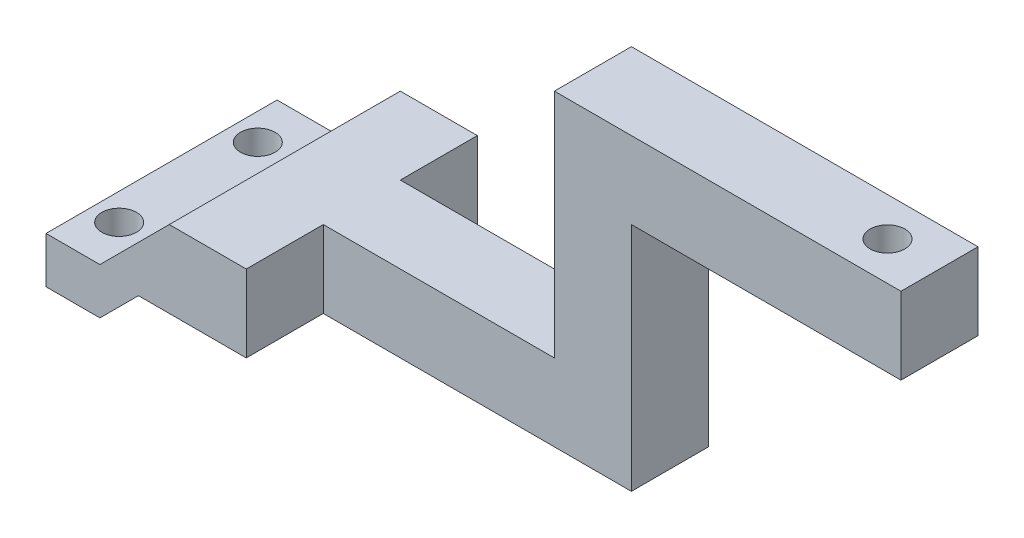
ISO-10303-21;
HEADER;
FILE_DESCRIPTION(('STEP AP214'),'2;1');
FILE_NAME('part.step','',(''),(''),'','','');
FILE_SCHEMA(('AUTOMOTIVE_DESIGN { 1 0 10303 214 1 1 1 1 }'));
ENDSEC;
DATA;
#1=APPLICATION_CONTEXT('core data for automotive mechanical design processes');
#2=APPLICATION_PROTOCOL_DEFINITION('international standard','automotive_design',2000,#1);
#3=PRODUCT_CONTEXT('',#1,'mechanical');
#4=PRODUCT('Part','Part','',(#3));
#5=PRODUCT_RELATED_PRODUCT_CATEGORY('part','',(#4));
#6=PRODUCT_DEFINITION_FORMATION('','',#4);
#7=PRODUCT_DEFINITION_CONTEXT('part definition',#1,'design');
#8=PRODUCT_DEFINITION('design','',#6,#7);
#9=PRODUCT_DEFINITION_SHAPE('','',#8);
#10=(LENGTH_UNIT() NAMED_UNIT(*) SI_UNIT(.MILLI.,.METRE.));
#11=(NAMED_UNIT(*) PLANE_ANGLE_UNIT() SI_UNIT($,.RADIAN.));
#12=(NAMED_UNIT(*) SI_UNIT($,.STERADIAN.) SOLID_ANGLE_UNIT());
#13=UNCERTAINTY_MEASURE_WITH_UNIT(LENGTH_MEASURE(1.E-05),#10,'distance_accuracy_value','');
#14=(GEOMETRIC_REPRESENTATION_CONTEXT(3) GLOBAL_UNCERTAINTY_ASSIGNED_CONTEXT((#13)) GLOBAL_UNIT_ASSIGNED_CONTEXT((#10,
#11,#12)) REPRESENTATION_CONTEXT('',''));
#15=CARTESIAN_POINT('',(0.,0.,0.));
#16=DIRECTION('',(0.,0.,1.));
#17=DIRECTION('',(1.,0.,0.));
#18=AXIS2_PLACEMENT_3D('',#15,#16,#17);
#19=CARTESIAN_POINT('',(66.,5.00000000000001,30.));
#20=DIRECTION('',(-1.,0.,0.));
#21=DIRECTION('',(0.,-1.,0.));
#22=AXIS2_PLACEMENT_3D('',#19,#20,#21);
#23=PLANE('',#22);
#24=DIRECTION('',(0.,-1.,0.));
#25=VECTOR('',#24,1.);
#26=CARTESIAN_POINT('',(66.,35.,10.));
#27=LINE('',#26,#25);
#28=CARTESIAN_POINT('',(66.,35.,10.));
#29=VERTEX_POINT('',#28);
#30=CARTESIAN_POINT('',(66.,5.00000000000001,10.));
#31=VERTEX_POINT('',#30);
#32=EDGE_CURVE('E147',#29,#31,#27,.T.);
#33=ORIENTED_EDGE('',*,*,#32,.F.);
#34=DIRECTION('',(0.,0.,-1.));
#35=VECTOR('',#34,1.);
#36=CARTESIAN_POINT('',(66.,35.,30.));
#37=LINE('',#36,#35);
#38=CARTESIAN_POINT('',(66.,35.,20.));
#39=VERTEX_POINT('',#38);
#40=EDGE_CURVE('E171',#39,#29,#37,.T.);
#41=ORIENTED_EDGE('',*,*,#40,.F.);
#42=DIRECTION('',(0.,1.,0.));
#43=VECTOR('',#42,1.);
#44=CARTESIAN_POINT('',(66.,5.00000000000001,20.));
#45=LINE('',#44,#43);
#46=CARTESIAN_POINT('',(66.,5.00000000000001,20.));
#47=VERTEX_POINT('',#46);
#48=EDGE_CURVE('E169',#47,#39,#45,.T.);
#49=ORIENTED_EDGE('',*,*,#48,.F.);
#50=DIRECTION('',(0.,0.,-1.));
#51=VECTOR('',#50,1.);
#52=CARTESIAN_POINT('',(66.,5.00000000000001,30.));
#53=LINE('',#52,#51);
#54=EDGE_CURVE('E164',#47,#31,#53,.T.);
#55=ORIENTED_EDGE('',*,*,#54,.T.);
#56=EDGE_LOOP('',(#33,#41,#49,#55));
#57=FACE_BOUND('',#56,.T.);
#58=ADVANCED_FACE('F33',(#57),#23,.F.);
#59=CARTESIAN_POINT('',(66.,35.,30.));
#60=DIRECTION('',(0.,1.,0.));
#61=DIRECTION('',(-1.,0.,0.));
#62=AXIS2_PLACEMENT_3D('',#59,#60,#61);
#63=PLANE('',#62);
#64=CARTESIAN_POINT('',(94.248435014587,35.,15.));
#65=DIRECTION('',(0.,1.,0.));
#66=DIRECTION('',(-1.,0.,0.));
#67=AXIS2_PLACEMENT_3D('',#64,#65,#66);
#68=CIRCLE('',#67,2.25);
#69=CARTESIAN_POINT('',(91.998435014587,35.,15.));
#70=VERTEX_POINT('',#69);
#71=EDGE_CURVE('E200',#70,#70,#68,.T.);
#72=ORIENTED_EDGE('',*,*,#71,.T.);
#73=EDGE_LOOP('',(#72));
#74=FACE_BOUND('',#73,.T.);
#75=DIRECTION('',(-1.,0.,0.));
#76=VECTOR('',#75,1.);
#77=CARTESIAN_POINT('',(101.,35.,10.));
#78=LINE('',#77,#76);
#79=CARTESIAN_POINT('',(101.,35.,10.));
#80=VERTEX_POINT('',#79);
#81=EDGE_CURVE('E153',#80,#29,#78,.T.);
#82=ORIENTED_EDGE('',*,*,#81,.F.);
#83=DIRECTION('',(0.,0.,-1.));
#84=VECTOR('',#83,1.);
#85=CARTESIAN_POINT('',(101.,35.,30.));
#86=LINE('',#85,#84);
#87=CARTESIAN_POINT('',(101.,35.,20.));
#88=VERTEX_POINT('',#87);
#89=EDGE_CURVE('E176',#88,#80,#86,.T.);
#90=ORIENTED_EDGE('',*,*,#89,.F.);
#91=DIRECTION('',(1.,0.,0.));
#92=VECTOR('',#91,1.);
#93=CARTESIAN_POINT('',(66.,35.,20.));
#94=LINE('',#93,#92);
#95=EDGE_CURVE('E237',#39,#88,#94,.T.);
#96=ORIENTED_EDGE('',*,*,#95,.F.);
#97=ORIENTED_EDGE('',*,*,#40,.T.);
#98=EDGE_LOOP('',(#82,#90,#96,#97));
#99=FACE_BOUND('',#98,.T.);
#100=ADVANCED_FACE('F343',(#74,#99),#63,.F.);
#101=CARTESIAN_POINT('',(101.,35.,30.));
#102=DIRECTION('',(-1.,0.,0.));
#103=DIRECTION('',(0.,-1.,0.));
#104=AXIS2_PLACEMENT_3D('',#101,#102,#103);
#105=PLANE('',#104);
#106=DIRECTION('',(0.,-1.,0.));
#107=VECTOR('',#106,1.);
#108=CARTESIAN_POINT('',(101.,45.,10.));
#109=LINE('',#108,#107);
#110=CARTESIAN_POINT('',(101.,45.,10.));
#111=VERTEX_POINT('',#110);
#112=EDGE_CURVE('E219',#111,#80,#109,.T.);
#113=ORIENTED_EDGE('',*,*,#112,.F.);
#114=DIRECTION('',(0.,0.,-1.));
#115=VECTOR('',#114,1.);
#116=CARTESIAN_POINT('',(101.,45.,30.));
#117=LINE('',#116,#115);
#118=CARTESIAN_POINT('',(101.,45.,20.));
#119=VERTEX_POINT('',#118);
#120=EDGE_CURVE('E182',#119,#111,#117,.T.);
#121=ORIENTED_EDGE('',*,*,#120,.F.);
#122=DIRECTION('',(0.,1.,0.));
#123=VECTOR('',#122,1.);
#124=CARTESIAN_POINT('',(101.,35.,20.));
#125=LINE('',#124,#123);
#126=EDGE_CURVE('E239',#88,#119,#125,.T.);
#127=ORIENTED_EDGE('',*,*,#126,.F.);
#128=ORIENTED_EDGE('',*,*,#89,.T.);
#129=EDGE_LOOP('',(#113,#121,#127,#128));
#130=FACE_BOUND('',#129,.T.);
#131=ADVANCED_FACE('F338',(#130),#105,.F.);
#132=CARTESIAN_POINT('',(101.,45.,30.));
#133=DIRECTION('',(0.,-1.,0.));
#134=DIRECTION('',(1.,0.,0.));
#135=AXIS2_PLACEMENT_3D('',#132,#133,#134);
#136=PLANE('',#135);
#137=CARTESIAN_POINT('',(94.248435014587,45.,15.));
#138=DIRECTION('',(0.,1.,0.));
#139=DIRECTION('',(-1.,0.,0.));
#140=AXIS2_PLACEMENT_3D('',#137,#138,#139);
#141=CIRCLE('',#140,2.25);
#142=CARTESIAN_POINT('',(91.998435014587,45.,15.));
#143=VERTEX_POINT('',#142);
#144=EDGE_CURVE('E195',#143,#143,#141,.T.);
#145=ORIENTED_EDGE('',*,*,#144,.F.);
#146=EDGE_LOOP('',(#145));
#147=FACE_BOUND('',#146,.T.);
#148=DIRECTION('',(1.,0.,0.));
#149=VECTOR('',#148,1.);
#150=CARTESIAN_POINT('',(56.,45.,10.));
#151=LINE('',#150,#149);
#152=CARTESIAN_POINT('',(56.,45.,10.));
#153=VERTEX_POINT('',#152);
#154=EDGE_CURVE('E217',#153,#111,#151,.T.);
#155=ORIENTED_EDGE('',*,*,#154,.F.);
#156=DIRECTION('',(0.,0.,-1.));
#157=VECTOR('',#156,1.);
#158=CARTESIAN_POINT('',(56.,45.,30.));
#159=LINE('',#158,#157);
#160=CARTESIAN_POINT('',(56.,45.,20.));
#161=VERTEX_POINT('',#160);
#162=EDGE_CURVE('E185',#161,#153,#159,.T.);
#163=ORIENTED_EDGE('',*,*,#162,.F.);
#164=DIRECTION('',(-1.,0.,0.));
#165=VECTOR('',#164,1.);
#166=CARTESIAN_POINT('',(101.,45.,20.));
#167=LINE('',#166,#165);
#168=EDGE_CURVE('E241',#119,#161,#167,.T.);
#169=ORIENTED_EDGE('',*,*,#168,.F.);
#170=ORIENTED_EDGE('',*,*,#120,.T.);
#171=EDGE_LOOP('',(#155,#163,#169,#170));
#172=FACE_BOUND('',#171,.T.);
#173=ADVANCED_FACE('F334',(#147,#172),#136,.F.);
#174=CARTESIAN_POINT('',(56.,45.,30.));
#175=DIRECTION('',(1.,0.,0.));
#176=DIRECTION('',(0.,1.,0.));
#177=AXIS2_PLACEMENT_3D('',#174,#175,#176);
#178=PLANE('',#177);
#179=DIRECTION('',(0.,1.,0.));
#180=VECTOR('',#179,1.);
#181=CARTESIAN_POINT('',(56.,15.,10.));
#182=LINE('',#181,#180);
#183=CARTESIAN_POINT('',(56.,15.,10.));
#184=VERTEX_POINT('',#183);
#185=EDGE_CURVE('E215',#184,#153,#182,.T.);
#186=ORIENTED_EDGE('',*,*,#185,.F.);
#187=DIRECTION('',(0.,0.,-1.));
#188=VECTOR('',#187,1.);
#189=CARTESIAN_POINT('',(56.,15.,30.));
#190=LINE('',#189,#188);
#191=CARTESIAN_POINT('',(56.,15.,20.));
#192=VERTEX_POINT('',#191);
#193=EDGE_CURVE('E188',#192,#184,#190,.T.);
#194=ORIENTED_EDGE('',*,*,#193,.F.);
#195=DIRECTION('',(0.,-1.,0.));
#196=VECTOR('',#195,1.);
#197=CARTESIAN_POINT('',(56.,45.,20.));
#198=LINE('',#197,#196);
#199=EDGE_CURVE('E243',#161,#192,#198,.T.);
#200=ORIENTED_EDGE('',*,*,#199,.F.);
#201=ORIENTED_EDGE('',*,*,#162,.T.);
#202=EDGE_LOOP('',(#186,#194,#200,#201));
#203=FACE_BOUND('',#202,.T.);
#204=ADVANCED_FACE('F326',(#203),#178,.F.);
#205=CARTESIAN_POINT('',(7.,6.,30.));
#206=DIRECTION('',(-0.707106781186549,0.707106781186546,0.));
#207=DIRECTION('',(-0.707106781186546,-0.707106781186549,0.));
#208=AXIS2_PLACEMENT_3D('',#205,#206,#207);
#209=PLANE('',#208);
#210=DIRECTION('',(0.707106781186546,0.707106781186549,0.));
#211=VECTOR('',#210,1.);
#212=CARTESIAN_POINT('',(7.,6.,0.));
#213=LINE('',#212,#211);
#214=CARTESIAN_POINT('',(7.,6.,0.));
#215=VERTEX_POINT('',#214);
#216=CARTESIAN_POINT('',(16.,15.,0.));
#217=VERTEX_POINT('',#216);
#218=EDGE_CURVE('E249',#215,#217,#213,.T.);
#219=ORIENTED_EDGE('',*,*,#218,.F.);
#220=DIRECTION('',(0.,0.,-1.));
#221=VECTOR('',#220,1.);
#222=CARTESIAN_POINT('',(7.,6.,30.));
#223=LINE('',#222,#221);
#224=CARTESIAN_POINT('',(7.,6.,30.));
#225=VERTEX_POINT('',#224);
#226=EDGE_CURVE('E11',#225,#215,#223,.T.);
#227=ORIENTED_EDGE('',*,*,#226,.F.);
#228=DIRECTION('',(0.707106781186546,0.707106781186549,0.));
#229=VECTOR('',#228,1.);
#230=CARTESIAN_POINT('',(7.,6.,30.));
#231=LINE('',#230,#229);
#232=CARTESIAN_POINT('',(16.,15.,30.));
#233=VERTEX_POINT('',#232);
#234=EDGE_CURVE('E251',#225,#233,#231,.T.);
#235=ORIENTED_EDGE('',*,*,#234,.T.);
#236=DIRECTION('',(0.,0.,-1.));
#237=VECTOR('',#236,1.);
#238=CARTESIAN_POINT('',(16.,15.,30.));
#239=LINE('',#238,#237);
#240=EDGE_CURVE('E191',#233,#217,#239,.T.);
#241=ORIENTED_EDGE('',*,*,#240,.T.);
#242=EDGE_LOOP('',(#219,#227,#235,#241));
#243=FACE_BOUND('',#242,.T.);
#244=ADVANCED_FACE('F35',(#243),#209,.T.);
#245=CARTESIAN_POINT('',(0.,6.,30.));
#246=DIRECTION('',(0.,1.,0.));
#247=DIRECTION('',(-1.,0.,0.));
#248=AXIS2_PLACEMENT_3D('',#245,#246,#247);
#249=PLANE('',#248);
#250=CARTESIAN_POINT('',(3.5,6.,24.));
#251=DIRECTION('',(0.,1.,0.));
#252=DIRECTION('',(-1.,0.,0.));
#253=AXIS2_PLACEMENT_3D('',#250,#251,#252);
#254=CIRCLE('',#253,2.25);
#255=CARTESIAN_POINT('',(1.25,6.,24.));
#256=VERTEX_POINT('',#255);
#257=EDGE_CURVE('E207',#256,#256,#254,.T.);
#258=ORIENTED_EDGE('',*,*,#257,.F.);
#259=EDGE_LOOP('',(#258));
#260=FACE_BOUND('',#259,.T.);
#261=CARTESIAN_POINT('',(3.5,6.,6.));
#262=DIRECTION('',(0.,1.,0.));
#263=DIRECTION('',(-1.,0.,0.));
#264=AXIS2_PLACEMENT_3D('',#261,#262,#263);
#265=CIRCLE('',#264,2.25);
#266=CARTESIAN_POINT('',(1.25,6.,6.));
#267=VERTEX_POINT('',#266);
#268=EDGE_CURVE('E196',#267,#267,#265,.T.);
#269=ORIENTED_EDGE('',*,*,#268,.F.);
#270=EDGE_LOOP('',(#269));
#271=FACE_BOUND('',#270,.T.);
#272=DIRECTION('',(1.,0.,0.));
#273=VECTOR('',#272,1.);
#274=CARTESIAN_POINT('',(0.,6.,0.));
#275=LINE('',#274,#273);
#276=CARTESIAN_POINT('',(0.,6.,0.));
#277=VERTEX_POINT('',#276);
#278=EDGE_CURVE('E255',#277,#215,#275,.T.);
#279=ORIENTED_EDGE('',*,*,#278,.F.);
#280=DIRECTION('',(0.,0.,-1.));
#281=VECTOR('',#280,1.);
#282=CARTESIAN_POINT('',(0.,6.,30.));
#283=LINE('',#282,#281);
#284=CARTESIAN_POINT('',(0.,6.,30.));
#285=VERTEX_POINT('',#284);
#286=EDGE_CURVE('E42',#285,#277,#283,.T.);
#287=ORIENTED_EDGE('',*,*,#286,.F.);
#288=DIRECTION('',(1.,0.,0.));
#289=VECTOR('',#288,1.);
#290=CARTESIAN_POINT('',(0.,6.,30.));
#291=LINE('',#290,#289);
#292=EDGE_CURVE('E192',#285,#225,#291,.T.);
#293=ORIENTED_EDGE('',*,*,#292,.T.);
#294=ORIENTED_EDGE('',*,*,#226,.T.);
#295=EDGE_LOOP('',(#279,#287,#293,#294));
#296=FACE_BOUND('',#295,.T.);
#297=ADVANCED_FACE('F313',(#260,#271,#296),#249,.T.);
#298=CARTESIAN_POINT('',(0.,0.,30.));
#299=DIRECTION('',(-1.,0.,0.));
#300=DIRECTION('',(0.,0.,1.));
#301=AXIS2_PLACEMENT_3D('',#298,#299,#300);
#302=PLANE('',#301);
#303=DIRECTION('',(0.,1.,0.));
#304=VECTOR('',#303,1.);
#305=CARTESIAN_POINT('',(0.,0.,0.));
#306=LINE('',#305,#304);
#307=CARTESIAN_POINT('',(0.,0.,0.));
#308=VERTEX_POINT('',#307);
#309=EDGE_CURVE('E284',#308,#277,#306,.T.);
#310=ORIENTED_EDGE('',*,*,#309,.F.);
#311=DIRECTION('',(0.,0.,-1.));
#312=VECTOR('',#311,1.);
#313=CARTESIAN_POINT('',(0.,0.,30.));
#314=LINE('',#313,#312);
#315=CARTESIAN_POINT('',(0.,0.,30.));
#316=VERTEX_POINT('',#315);
#317=EDGE_CURVE('E290',#316,#308,#314,.T.);
#318=ORIENTED_EDGE('',*,*,#317,.F.);
#319=DIRECTION('',(0.,1.,0.));
#320=VECTOR('',#319,1.);
#321=CARTESIAN_POINT('',(0.,0.,30.));
#322=LINE('',#321,#320);
#323=EDGE_CURVE('E266',#316,#285,#322,.T.);
#324=ORIENTED_EDGE('',*,*,#323,.T.);
#325=ORIENTED_EDGE('',*,*,#286,.T.);
#326=EDGE_LOOP('',(#310,#318,#324,#325));
#327=FACE_BOUND('',#326,.T.);
#328=ADVANCED_FACE('F310',(#327),#302,.T.);
#329=CARTESIAN_POINT('',(7.,0.,30.));
#330=DIRECTION('',(0.,-1.,0.));
#331=DIRECTION('',(1.,0.,0.));
#332=AXIS2_PLACEMENT_3D('',#329,#330,#331);
#333=PLANE('',#332);
#334=CARTESIAN_POINT('',(3.50000000000001,0.,24.));
#335=DIRECTION('',(0.,-1.,0.));
#336=DIRECTION('',(1.,0.,0.));
#337=AXIS2_PLACEMENT_3D('',#334,#335,#336);
#338=CIRCLE('',#337,2.25);
#339=CARTESIAN_POINT('',(5.75000000000001,0.,24.));
#340=VERTEX_POINT('',#339);
#341=EDGE_CURVE('E37',#340,#340,#338,.T.);
#342=ORIENTED_EDGE('',*,*,#341,.F.);
#343=EDGE_LOOP('',(#342));
#344=FACE_BOUND('',#343,.T.);
#345=CARTESIAN_POINT('',(3.5,0.,6.));
#346=DIRECTION('',(0.,-1.,0.));
#347=DIRECTION('',(1.,0.,0.));
#348=AXIS2_PLACEMENT_3D('',#345,#346,#347);
#349=CIRCLE('',#348,2.25);
#350=CARTESIAN_POINT('',(5.75,0.,6.));
#351=VERTEX_POINT('',#350);
#352=EDGE_CURVE('E193',#351,#351,#349,.T.);
#353=ORIENTED_EDGE('',*,*,#352,.F.);
#354=EDGE_LOOP('',(#353));
#355=FACE_BOUND('',#354,.T.);
#356=DIRECTION('',(-1.,0.,0.));
#357=VECTOR('',#356,1.);
#358=CARTESIAN_POINT('',(7.,0.,0.));
#359=LINE('',#358,#357);
#360=CARTESIAN_POINT('',(7.,0.,0.));
#361=VERTEX_POINT('',#360);
#362=EDGE_CURVE('E281',#361,#308,#359,.T.);
#363=ORIENTED_EDGE('',*,*,#362,.F.);
#364=DIRECTION('',(0.,0.,-1.));
#365=VECTOR('',#364,1.);
#366=CARTESIAN_POINT('',(7.,0.,30.));
#367=LINE('',#366,#365);
#368=CARTESIAN_POINT('',(7.,0.,30.));
#369=VERTEX_POINT('',#368);
#370=EDGE_CURVE('E174',#369,#361,#367,.T.);
#371=ORIENTED_EDGE('',*,*,#370,.F.);
#372=DIRECTION('',(-1.,0.,0.));
#373=VECTOR('',#372,1.);
#374=CARTESIAN_POINT('',(7.,0.,30.));
#375=LINE('',#374,#373);
#376=EDGE_CURVE('E263',#369,#316,#375,.T.);
#377=ORIENTED_EDGE('',*,*,#376,.T.);
#378=ORIENTED_EDGE('',*,*,#317,.T.);
#379=EDGE_LOOP('',(#363,#371,#377,#378));
#380=FACE_BOUND('',#379,.T.);
#381=ADVANCED_FACE('F299',(#344,#355,#380),#333,.T.);
#382=CARTESIAN_POINT('',(12.,5.,30.));
#383=DIRECTION('',(0.707106781186549,-0.707106781186546,0.));
#384=DIRECTION('',(0.707106781186546,0.707106781186549,0.));
#385=AXIS2_PLACEMENT_3D('',#382,#383,#384);
#386=PLANE('',#385);
#387=DIRECTION('',(-0.707106781186546,-0.707106781186549,0.));
#388=VECTOR('',#387,1.);
#389=CARTESIAN_POINT('',(12.,5.,0.));
#390=LINE('',#389,#388);
#391=CARTESIAN_POINT('',(12.,5.,0.));
#392=VERTEX_POINT('',#391);
#393=EDGE_CURVE('E278',#392,#361,#390,.T.);
#394=ORIENTED_EDGE('',*,*,#393,.F.);
#395=DIRECTION('',(0.,0.,-1.));
#396=VECTOR('',#395,1.);
#397=CARTESIAN_POINT('',(12.,5.,30.));
#398=LINE('',#397,#396);
#399=CARTESIAN_POINT('',(12.,5.,30.));
#400=VERTEX_POINT('',#399);
#401=EDGE_CURVE('E170',#400,#392,#398,.T.);
#402=ORIENTED_EDGE('',*,*,#401,.F.);
#403=DIRECTION('',(-0.707106781186546,-0.707106781186549,0.));
#404=VECTOR('',#403,1.);
#405=CARTESIAN_POINT('',(12.,5.,30.));
#406=LINE('',#405,#404);
#407=EDGE_CURVE('E260',#400,#369,#406,.T.);
#408=ORIENTED_EDGE('',*,*,#407,.T.);
#409=ORIENTED_EDGE('',*,*,#370,.T.);
#410=EDGE_LOOP('',(#394,#402,#408,#409));
#411=FACE_BOUND('',#410,.T.);
#412=ADVANCED_FACE('F294',(#411),#386,.T.);
#413=CARTESIAN_POINT('',(66.,5.00000000000001,30.));
#414=DIRECTION('',(0.,-1.,0.));
#415=DIRECTION('',(1.,0.,0.));
#416=AXIS2_PLACEMENT_3D('',#413,#414,#415);
#417=PLANE('',#416);
#418=DIRECTION('',(0.,0.,-1.));
#419=VECTOR('',#418,1.);
#420=CARTESIAN_POINT('',(26.,5.00000000000001,10.));
#421=LINE('',#420,#419);
#422=CARTESIAN_POINT('',(26.,5.00000000000001,10.));
#423=VERTEX_POINT('',#422);
#424=CARTESIAN_POINT('',(26.,5.,0.));
#425=VERTEX_POINT('',#424);
#426=EDGE_CURVE('E50',#423,#425,#421,.T.);
#427=ORIENTED_EDGE('',*,*,#426,.F.);
#428=DIRECTION('',(-1.,0.,0.));
#429=VECTOR('',#428,1.);
#430=CARTESIAN_POINT('',(66.,5.00000000000001,10.));
#431=LINE('',#430,#429);
#432=EDGE_CURVE('E151',#31,#423,#431,.T.);
#433=ORIENTED_EDGE('',*,*,#432,.F.);
#434=ORIENTED_EDGE('',*,*,#54,.F.);
#435=DIRECTION('',(1.,0.,0.));
#436=VECTOR('',#435,1.);
#437=CARTESIAN_POINT('',(26.,5.00000000000001,20.));
#438=LINE('',#437,#436);
#439=CARTESIAN_POINT('',(26.,5.00000000000001,20.));
#440=VERTEX_POINT('',#439);
#441=EDGE_CURVE('E234',#440,#47,#438,.T.);
#442=ORIENTED_EDGE('',*,*,#441,.F.);
#443=DIRECTION('',(0.,0.,1.));
#444=VECTOR('',#443,1.);
#445=CARTESIAN_POINT('',(26.,5.00000000000001,20.));
#446=LINE('',#445,#444);
#447=CARTESIAN_POINT('',(26.,5.00000000000001,30.));
#448=VERTEX_POINT('',#447);
#449=EDGE_CURVE('E246',#440,#448,#446,.T.);
#450=ORIENTED_EDGE('',*,*,#449,.T.);
#451=DIRECTION('',(-1.,0.,0.));
#452=VECTOR('',#451,1.);
#453=CARTESIAN_POINT('',(66.,5.00000000000001,30.));
#454=LINE('',#453,#452);
#455=EDGE_CURVE('E258',#448,#400,#454,.T.);
#456=ORIENTED_EDGE('',*,*,#455,.T.);
#457=ORIENTED_EDGE('',*,*,#401,.T.);
#458=DIRECTION('',(-1.,0.,0.));
#459=VECTOR('',#458,1.);
#460=CARTESIAN_POINT('',(66.,5.00000000000001,0.));
#461=LINE('',#460,#459);
#462=EDGE_CURVE('E276',#425,#392,#461,.T.);
#463=ORIENTED_EDGE('',*,*,#462,.F.);
#464=EDGE_LOOP('',(#427,#433,#434,#442,#450,#456,#457,#463));
#465=FACE_BOUND('',#464,.T.);
#466=ADVANCED_FACE('F162',(#465),#417,.T.);
#467=CARTESIAN_POINT('',(16.,15.,30.));
#468=DIRECTION('',(0.,1.,0.));
#469=DIRECTION('',(-1.,0.,0.));
#470=AXIS2_PLACEMENT_3D('',#467,#468,#469);
#471=PLANE('',#470);
#472=DIRECTION('',(0.,0.,-1.));
#473=VECTOR('',#472,1.);
#474=CARTESIAN_POINT('',(26.,15.,10.));
#475=LINE('',#474,#473);
#476=CARTESIAN_POINT('',(26.,15.,10.));
#477=VERTEX_POINT('',#476);
#478=CARTESIAN_POINT('',(26.,15.,0.));
#479=VERTEX_POINT('',#478);
#480=EDGE_CURVE('E223',#477,#479,#475,.T.);
#481=ORIENTED_EDGE('',*,*,#480,.T.);
#482=DIRECTION('',(1.,0.,0.));
#483=VECTOR('',#482,1.);
#484=CARTESIAN_POINT('',(16.,15.,0.));
#485=LINE('',#484,#483);
#486=EDGE_CURVE('E273',#217,#479,#485,.T.);
#487=ORIENTED_EDGE('',*,*,#486,.F.);
#488=ORIENTED_EDGE('',*,*,#240,.F.);
#489=DIRECTION('',(1.,0.,0.));
#490=VECTOR('',#489,1.);
#491=CARTESIAN_POINT('',(16.,15.,30.));
#492=LINE('',#491,#490);
#493=CARTESIAN_POINT('',(26.,15.,30.));
#494=VERTEX_POINT('',#493);
#495=EDGE_CURVE('E254',#233,#494,#492,.T.);
#496=ORIENTED_EDGE('',*,*,#495,.T.);
#497=DIRECTION('',(0.,0.,1.));
#498=VECTOR('',#497,1.);
#499=CARTESIAN_POINT('',(26.,15.,20.));
#500=LINE('',#499,#498);
#501=CARTESIAN_POINT('',(26.,15.,20.));
#502=VERTEX_POINT('',#501);
#503=EDGE_CURVE('E58',#502,#494,#500,.T.);
#504=ORIENTED_EDGE('',*,*,#503,.F.);
#505=DIRECTION('',(-1.,0.,0.));
#506=VECTOR('',#505,1.);
#507=CARTESIAN_POINT('',(56.,15.,20.));
#508=LINE('',#507,#506);
#509=EDGE_CURVE('E228',#192,#502,#508,.T.);
#510=ORIENTED_EDGE('',*,*,#509,.F.);
#511=ORIENTED_EDGE('',*,*,#193,.T.);
#512=DIRECTION('',(1.,0.,0.));
#513=VECTOR('',#512,1.);
#514=CARTESIAN_POINT('',(26.,15.,10.));
#515=LINE('',#514,#513);
#516=EDGE_CURVE('E213',#477,#184,#515,.T.);
#517=ORIENTED_EDGE('',*,*,#516,.F.);
#518=EDGE_LOOP('',(#481,#487,#488,#496,#504,#510,#511,#517));
#519=FACE_BOUND('',#518,.T.);
#520=ADVANCED_FACE('F318',(#519),#471,.T.);
#521=CARTESIAN_POINT('',(0.,0.,30.));
#522=DIRECTION('',(0.,0.,-1.));
#523=DIRECTION('',(-1.,0.,0.));
#524=AXIS2_PLACEMENT_3D('',#521,#522,#523);
#525=PLANE('',#524);
#526=ORIENTED_EDGE('',*,*,#455,.F.);
#527=DIRECTION('',(0.,-1.,0.));
#528=VECTOR('',#527,1.);
#529=CARTESIAN_POINT('',(26.,15.,30.));
#530=LINE('',#529,#528);
#531=EDGE_CURVE('E226',#494,#448,#530,.T.);
#532=ORIENTED_EDGE('',*,*,#531,.F.);
#533=ORIENTED_EDGE('',*,*,#495,.F.);
#534=ORIENTED_EDGE('',*,*,#234,.F.);
#535=ORIENTED_EDGE('',*,*,#292,.F.);
#536=ORIENTED_EDGE('',*,*,#323,.F.);
#537=ORIENTED_EDGE('',*,*,#376,.F.);
#538=ORIENTED_EDGE('',*,*,#407,.F.);
#539=EDGE_LOOP('',(#526,#532,#533,#534,#535,#536,#537,#538));
#540=FACE_BOUND('',#539,.T.);
#541=ADVANCED_FACE('F305',(#540),#525,.F.);
#542=CARTESIAN_POINT('',(0.,0.,0.));
#543=DIRECTION('',(0.,0.,-1.));
#544=DIRECTION('',(-1.,0.,0.));
#545=AXIS2_PLACEMENT_3D('',#542,#543,#544);
#546=PLANE('',#545);
#547=DIRECTION('',(0.,1.,0.));
#548=VECTOR('',#547,1.);
#549=CARTESIAN_POINT('',(26.,5.00000000000001,0.));
#550=LINE('',#549,#548);
#551=EDGE_CURVE('E158',#425,#479,#550,.T.);
#552=ORIENTED_EDGE('',*,*,#551,.F.);
#553=ORIENTED_EDGE('',*,*,#462,.T.);
#554=ORIENTED_EDGE('',*,*,#393,.T.);
#555=ORIENTED_EDGE('',*,*,#362,.T.);
#556=ORIENTED_EDGE('',*,*,#309,.T.);
#557=ORIENTED_EDGE('',*,*,#278,.T.);
#558=ORIENTED_EDGE('',*,*,#218,.T.);
#559=ORIENTED_EDGE('',*,*,#486,.T.);
#560=EDGE_LOOP('',(#552,#553,#554,#555,#556,#557,#558,#559));
#561=FACE_BOUND('',#560,.T.);
#562=ADVANCED_FACE('F302',(#561),#546,.T.);
#563=CARTESIAN_POINT('',(26.,15.,20.));
#564=DIRECTION('',(-1.,0.,0.));
#565=DIRECTION('',(0.,0.,1.));
#566=AXIS2_PLACEMENT_3D('',#563,#564,#565);
#567=PLANE('',#566);
#568=ORIENTED_EDGE('',*,*,#531,.T.);
#569=ORIENTED_EDGE('',*,*,#449,.F.);
#570=DIRECTION('',(0.,-1.,0.));
#571=VECTOR('',#570,1.);
#572=CARTESIAN_POINT('',(26.,15.,20.));
#573=LINE('',#572,#571);
#574=EDGE_CURVE('E231',#502,#440,#573,.T.);
#575=ORIENTED_EDGE('',*,*,#574,.F.);
#576=ORIENTED_EDGE('',*,*,#503,.T.);
#577=EDGE_LOOP('',(#568,#569,#575,#576));
#578=FACE_BOUND('',#577,.T.);
#579=ADVANCED_FACE('F344',(#578),#567,.F.);
#580=CARTESIAN_POINT('',(0.,0.,20.));
#581=DIRECTION('',(0.,0.,1.));
#582=DIRECTION('',(1.,0.,0.));
#583=AXIS2_PLACEMENT_3D('',#580,#581,#582);
#584=PLANE('',#583);
#585=ORIENTED_EDGE('',*,*,#509,.T.);
#586=ORIENTED_EDGE('',*,*,#574,.T.);
#587=ORIENTED_EDGE('',*,*,#441,.T.);
#588=ORIENTED_EDGE('',*,*,#48,.T.);
#589=ORIENTED_EDGE('',*,*,#95,.T.);
#590=ORIENTED_EDGE('',*,*,#126,.T.);
#591=ORIENTED_EDGE('',*,*,#168,.T.);
#592=ORIENTED_EDGE('',*,*,#199,.T.);
#593=EDGE_LOOP('',(#585,#586,#587,#588,#589,#590,#591,#592));
#594=FACE_BOUND('',#593,.T.);
#595=ADVANCED_FACE('F331',(#594),#584,.T.);
#596=CARTESIAN_POINT('',(26.,5.00000000000001,10.));
#597=DIRECTION('',(-1.,0.,0.));
#598=DIRECTION('',(0.,-1.,0.));
#599=AXIS2_PLACEMENT_3D('',#596,#597,#598);
#600=PLANE('',#599);
#601=ORIENTED_EDGE('',*,*,#551,.T.);
#602=ORIENTED_EDGE('',*,*,#480,.F.);
#603=DIRECTION('',(0.,1.,0.));
#604=VECTOR('',#603,1.);
#605=CARTESIAN_POINT('',(26.,5.00000000000001,10.));
#606=LINE('',#605,#604);
#607=EDGE_CURVE('E166',#423,#477,#606,.T.);
#608=ORIENTED_EDGE('',*,*,#607,.F.);
#609=ORIENTED_EDGE('',*,*,#426,.T.);
#610=EDGE_LOOP('',(#601,#602,#608,#609));
#611=FACE_BOUND('',#610,.T.);
#612=ADVANCED_FACE('F321',(#611),#600,.F.);
#613=CARTESIAN_POINT('',(0.,0.,10.));
#614=DIRECTION('',(0.,0.,-1.));
#615=DIRECTION('',(-1.,0.,0.));
#616=AXIS2_PLACEMENT_3D('',#613,#614,#615);
#617=PLANE('',#616);
#618=ORIENTED_EDGE('',*,*,#32,.T.);
#619=ORIENTED_EDGE('',*,*,#432,.T.);
#620=ORIENTED_EDGE('',*,*,#607,.T.);
#621=ORIENTED_EDGE('',*,*,#516,.T.);
#622=ORIENTED_EDGE('',*,*,#185,.T.);
#623=ORIENTED_EDGE('',*,*,#154,.T.);
#624=ORIENTED_EDGE('',*,*,#112,.T.);
#625=ORIENTED_EDGE('',*,*,#81,.T.);
#626=EDGE_LOOP('',(#618,#619,#620,#621,#622,#623,#624,#625));
#627=FACE_BOUND('',#626,.T.);
#628=ADVANCED_FACE('F149',(#627),#617,.T.);
#629=CARTESIAN_POINT('',(94.248435014587,0.,15.));
#630=DIRECTION('',(0.,1.,0.));
#631=DIRECTION('',(-1.,0.,0.));
#632=AXIS2_PLACEMENT_3D('',#629,#630,#631);
#633=CYLINDRICAL_SURFACE('',#632,2.25);
#634=ORIENTED_EDGE('',*,*,#144,.T.);
#635=EDGE_LOOP('',(#634));
#636=FACE_BOUND('',#635,.T.);
#637=ORIENTED_EDGE('',*,*,#71,.F.);
#638=EDGE_LOOP('',(#637));
#639=FACE_BOUND('',#638,.T.);
#640=ADVANCED_FACE('F403',(#636,#639),#633,.F.);
#641=CARTESIAN_POINT('',(3.5,-4.,6.));
#642=DIRECTION('',(0.,1.,0.));
#643=DIRECTION('',(-1.,0.,0.));
#644=AXIS2_PLACEMENT_3D('',#641,#642,#643);
#645=CYLINDRICAL_SURFACE('',#644,2.25);
#646=ORIENTED_EDGE('',*,*,#352,.T.);
#647=EDGE_LOOP('',(#646));
#648=FACE_BOUND('',#647,.T.);
#649=ORIENTED_EDGE('',*,*,#268,.T.);
#650=EDGE_LOOP('',(#649));
#651=FACE_BOUND('',#650,.T.);
#652=ADVANCED_FACE('F397',(#648,#651),#645,.F.);
#653=CARTESIAN_POINT('',(3.50000000000001,-4.,24.));
#654=DIRECTION('',(0.,1.,0.));
#655=DIRECTION('',(-1.,0.,0.));
#656=AXIS2_PLACEMENT_3D('',#653,#654,#655);
#657=CYLINDRICAL_SURFACE('',#656,2.25);
#658=ORIENTED_EDGE('',*,*,#341,.T.);
#659=EDGE_LOOP('',(#658));
#660=FACE_BOUND('',#659,.T.);
#661=ORIENTED_EDGE('',*,*,#257,.T.);
#662=EDGE_LOOP('',(#661));
#663=FACE_BOUND('',#662,.T.);
#664=ADVANCED_FACE('F395',(#660,#663),#657,.F.);
#665=CLOSED_SHELL('',(#58,#100,#131,#173,#204,#244,#297,#328,#381,#412,#466,#520,#541,#562,#579,
#595,#612,#628,#640,#652,#664));
#666=MANIFOLD_SOLID_BREP('B2',#665);
#667=ADVANCED_BREP_SHAPE_REPRESENTATION('',(#18,#666),#14);
#668=SHAPE_DEFINITION_REPRESENTATION(#9,#667);
ENDSEC;
END-ISO-10303-21;
